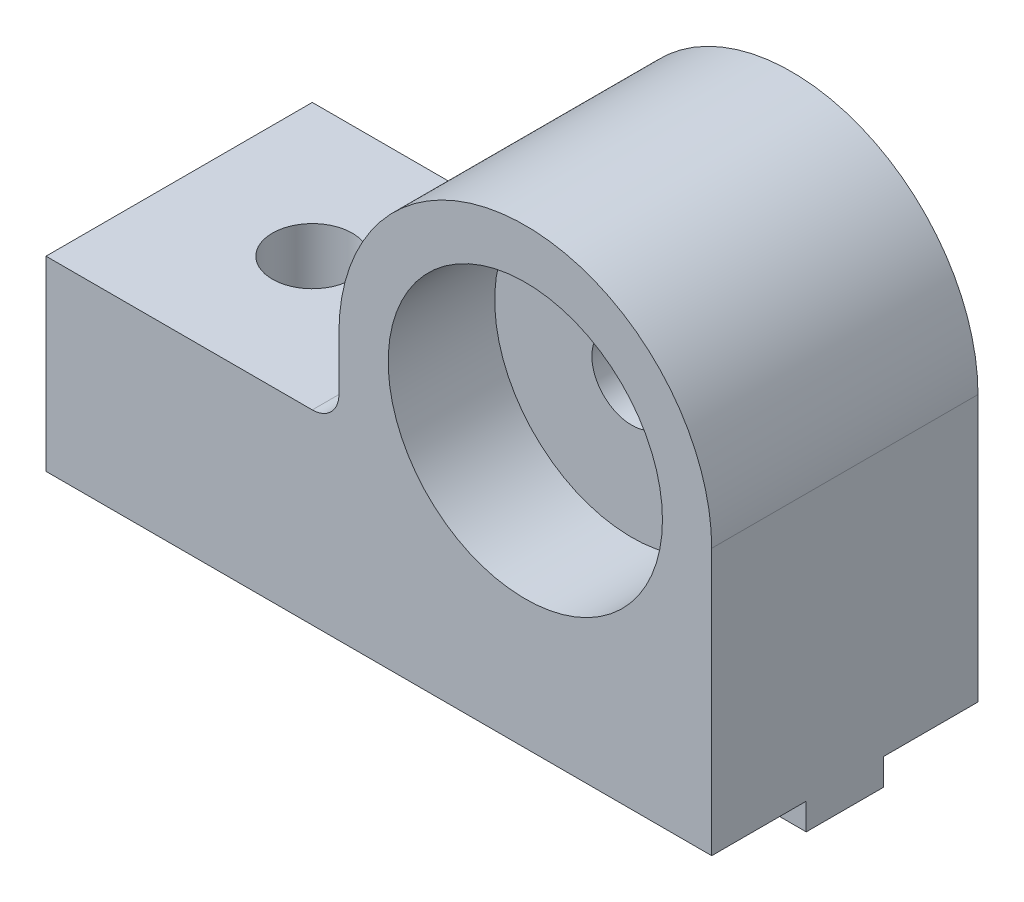
ISO-10303-21;
HEADER;
FILE_DESCRIPTION(('STEP AP214'),'2;1');
FILE_NAME('part.step','',(''),(''),'','','');
FILE_SCHEMA(('AUTOMOTIVE_DESIGN { 1 0 10303 214 1 1 1 1 }'));
ENDSEC;
DATA;
#1=APPLICATION_CONTEXT('core data for automotive mechanical design processes');
#2=APPLICATION_PROTOCOL_DEFINITION('international standard','automotive_design',2000,#1);
#3=PRODUCT_CONTEXT('',#1,'mechanical');
#4=PRODUCT('Part','Part','',(#3));
#5=PRODUCT_RELATED_PRODUCT_CATEGORY('part','',(#4));
#6=PRODUCT_DEFINITION_FORMATION('','',#4);
#7=PRODUCT_DEFINITION_CONTEXT('part definition',#1,'design');
#8=PRODUCT_DEFINITION('design','',#6,#7);
#9=PRODUCT_DEFINITION_SHAPE('','',#8);
#10=(LENGTH_UNIT() NAMED_UNIT(*) SI_UNIT(.MILLI.,.METRE.));
#11=(NAMED_UNIT(*) PLANE_ANGLE_UNIT() SI_UNIT($,.RADIAN.));
#12=(NAMED_UNIT(*) SI_UNIT($,.STERADIAN.) SOLID_ANGLE_UNIT());
#13=UNCERTAINTY_MEASURE_WITH_UNIT(LENGTH_MEASURE(1.E-05),#10,'distance_accuracy_value','');
#14=(GEOMETRIC_REPRESENTATION_CONTEXT(3) GLOBAL_UNCERTAINTY_ASSIGNED_CONTEXT((#13)) GLOBAL_UNIT_ASSIGNED_CONTEXT((#10,
#11,#12)) REPRESENTATION_CONTEXT('',''));
#15=CARTESIAN_POINT('',(0.,0.,0.));
#16=DIRECTION('',(0.,0.,1.));
#17=DIRECTION('',(1.,0.,0.));
#18=AXIS2_PLACEMENT_3D('',#15,#16,#17);
#19=CARTESIAN_POINT('',(0.,10.,5.));
#20=DIRECTION('',(0.,0.,-1.));
#21=DIRECTION('',(-1.,0.,0.));
#22=AXIS2_PLACEMENT_3D('',#19,#20,#21);
#23=CYLINDRICAL_SURFACE('',#22,1.5);
#24=CARTESIAN_POINT('',(0.,10.,1.));
#25=DIRECTION('',(0.,0.,1.));
#26=DIRECTION('',(1.,0.,0.));
#27=AXIS2_PLACEMENT_3D('',#24,#25,#26);
#28=CIRCLE('',#27,1.5);
#29=CARTESIAN_POINT('',(1.5,10.,1.));
#30=VERTEX_POINT('',#29);
#31=EDGE_CURVE('E224',#30,#30,#28,.T.);
#32=ORIENTED_EDGE('',*,*,#31,.T.);
#33=EDGE_LOOP('',(#32));
#34=FACE_BOUND('',#33,.T.);
#35=CARTESIAN_POINT('',(0.,10.,-1.));
#36=DIRECTION('',(0.,0.,-1.));
#37=DIRECTION('',(-1.,0.,0.));
#38=AXIS2_PLACEMENT_3D('',#35,#36,#37);
#39=CIRCLE('',#38,1.5);
#40=CARTESIAN_POINT('',(-1.5,10.,-1.));
#41=VERTEX_POINT('',#40);
#42=EDGE_CURVE('E228',#41,#41,#39,.T.);
#43=ORIENTED_EDGE('',*,*,#42,.T.);
#44=EDGE_LOOP('',(#43));
#45=FACE_BOUND('',#44,.T.);
#46=ADVANCED_FACE('F33',(#34,#45),#23,.F.);
#47=CARTESIAN_POINT('',(10.0675723300356,0.,-1.45));
#48=DIRECTION('',(0.,0.,-1.));
#49=DIRECTION('',(-1.,0.,0.));
#50=AXIS2_PLACEMENT_3D('',#47,#48,#49);
#51=PLANE('',#50);
#52=DIRECTION('',(0.,1.,0.));
#53=VECTOR('',#52,1.);
#54=CARTESIAN_POINT('',(-13.3840572873934,-1.,-1.45));
#55=LINE('',#54,#53);
#56=CARTESIAN_POINT('',(-13.3840572873934,-1.,-1.45));
#57=VERTEX_POINT('',#56);
#58=CARTESIAN_POINT('',(-13.3840572873934,0.,-1.45));
#59=VERTEX_POINT('',#58);
#60=EDGE_CURVE('E477',#57,#59,#55,.T.);
#61=ORIENTED_EDGE('',*,*,#60,.F.);
#62=DIRECTION('',(-1.,0.,0.));
#63=VECTOR('',#62,1.);
#64=CARTESIAN_POINT('',(10.0675723300356,-0.99999999999999,-1.45));
#65=LINE('',#64,#63);
#66=CARTESIAN_POINT('',(-18.,-0.999999999999997,-1.45));
#67=VERTEX_POINT('',#66);
#68=EDGE_CURVE('E158',#57,#67,#65,.T.);
#69=ORIENTED_EDGE('',*,*,#68,.T.);
#70=DIRECTION('',(0.,-1.,0.));
#71=VECTOR('',#70,1.);
#72=CARTESIAN_POINT('',(-18.,0.,-1.45));
#73=LINE('',#72,#71);
#74=CARTESIAN_POINT('',(-18.,0.,-1.45));
#75=VERTEX_POINT('',#74);
#76=EDGE_CURVE('E474',#75,#67,#73,.T.);
#77=ORIENTED_EDGE('',*,*,#76,.F.);
#78=DIRECTION('',(-1.,0.,0.));
#79=VECTOR('',#78,1.);
#80=CARTESIAN_POINT('',(10.0675723300356,0.,-1.45));
#81=LINE('',#80,#79);
#82=EDGE_CURVE('E479',#59,#75,#81,.T.);
#83=ORIENTED_EDGE('',*,*,#82,.F.);
#84=EDGE_LOOP('',(#61,#69,#77,#83));
#85=FACE_BOUND('',#84,.T.);
#86=ADVANCED_FACE('F265',(#85),#51,.T.);
#87=CARTESIAN_POINT('',(10.0675723300356,0.,1.45));
#88=DIRECTION('',(0.,0.,1.));
#89=DIRECTION('',(1.,0.,0.));
#90=AXIS2_PLACEMENT_3D('',#87,#88,#89);
#91=PLANE('',#90);
#92=DIRECTION('',(0.,1.,0.));
#93=VECTOR('',#92,1.);
#94=CARTESIAN_POINT('',(-12.6159427126066,-1.,1.45));
#95=LINE('',#94,#93);
#96=CARTESIAN_POINT('',(-12.6159427126066,-1.,1.45));
#97=VERTEX_POINT('',#96);
#98=CARTESIAN_POINT('',(-12.6159427126066,0.,1.45));
#99=VERTEX_POINT('',#98);
#100=EDGE_CURVE('E456',#97,#99,#95,.T.);
#101=ORIENTED_EDGE('',*,*,#100,.F.);
#102=DIRECTION('',(-1.,0.,0.));
#103=VECTOR('',#102,1.);
#104=CARTESIAN_POINT('',(10.0675723300356,-0.99999999999999,1.45));
#105=LINE('',#104,#103);
#106=CARTESIAN_POINT('',(7.,-0.999999999999991,1.45));
#107=VERTEX_POINT('',#106);
#108=EDGE_CURVE('E166',#107,#97,#105,.T.);
#109=ORIENTED_EDGE('',*,*,#108,.F.);
#110=DIRECTION('',(0.,-1.,0.));
#111=VECTOR('',#110,1.);
#112=CARTESIAN_POINT('',(7.,0.,1.45));
#113=LINE('',#112,#111);
#114=CARTESIAN_POINT('',(7.,0.,1.45));
#115=VERTEX_POINT('',#114);
#116=EDGE_CURVE('E466',#115,#107,#113,.T.);
#117=ORIENTED_EDGE('',*,*,#116,.F.);
#118=DIRECTION('',(-1.,0.,0.));
#119=VECTOR('',#118,1.);
#120=CARTESIAN_POINT('',(10.0675723300356,0.,1.45));
#121=LINE('',#120,#119);
#122=EDGE_CURVE('E174',#115,#99,#121,.T.);
#123=ORIENTED_EDGE('',*,*,#122,.T.);
#124=EDGE_LOOP('',(#101,#109,#117,#123));
#125=FACE_BOUND('',#124,.T.);
#126=ADVANCED_FACE('F271',(#125),#91,.T.);
#127=CARTESIAN_POINT('',(10.0675723300356,-0.99999999999999,-1.45));
#128=DIRECTION('',(0.,-1.,0.));
#129=DIRECTION('',(1.,0.,0.));
#130=AXIS2_PLACEMENT_3D('',#127,#128,#129);
#131=PLANE('',#130);
#132=CARTESIAN_POINT('',(-13.,-0.999999999999996,0.));
#133=DIRECTION('',(0.,-1.,0.));
#134=DIRECTION('',(1.,0.,0.));
#135=AXIS2_PLACEMENT_3D('',#132,#133,#134);
#136=CIRCLE('',#135,1.5);
#137=CARTESIAN_POINT('',(-13.3840572873934,-1.,1.45));
#138=VERTEX_POINT('',#137);
#139=EDGE_CURVE('E143',#138,#57,#136,.T.);
#140=ORIENTED_EDGE('',*,*,#139,.F.);
#141=CARTESIAN_POINT('',(-18.,-0.999999999999997,1.45));
#142=VERTEX_POINT('',#141);
#143=EDGE_CURVE('E156',#138,#142,#105,.T.);
#144=ORIENTED_EDGE('',*,*,#143,.T.);
#145=DIRECTION('',(0.,0.,1.));
#146=VECTOR('',#145,1.);
#147=CARTESIAN_POINT('',(-18.,-0.999999999999997,-1.45));
#148=LINE('',#147,#146);
#149=EDGE_CURVE('E476',#67,#142,#148,.T.);
#150=ORIENTED_EDGE('',*,*,#149,.F.);
#151=ORIENTED_EDGE('',*,*,#68,.F.);
#152=EDGE_LOOP('',(#140,#144,#150,#151));
#153=FACE_BOUND('',#152,.T.);
#154=ADVANCED_FACE('F154',(#153),#131,.T.);
#155=CARTESIAN_POINT('',(-18.,0.,5.));
#156=DIRECTION('',(0.,1.,0.));
#157=DIRECTION('',(0.,0.,1.));
#158=AXIS2_PLACEMENT_3D('',#155,#156,#157);
#159=PLANE('',#158);
#160=CARTESIAN_POINT('',(-13.3840572873934,0.,1.45));
#161=VERTEX_POINT('',#160);
#162=CARTESIAN_POINT('',(-18.,0.,1.45));
#163=VERTEX_POINT('',#162);
#164=EDGE_CURVE('E170',#161,#163,#121,.T.);
#165=ORIENTED_EDGE('',*,*,#164,.F.);
#166=CARTESIAN_POINT('',(-13.,0.,0.));
#167=DIRECTION('',(0.,1.,0.));
#168=DIRECTION('',(0.,0.,1.));
#169=AXIS2_PLACEMENT_3D('',#166,#167,#168);
#170=CIRCLE('',#169,1.5);
#171=EDGE_CURVE('E146',#161,#99,#170,.T.);
#172=ORIENTED_EDGE('',*,*,#171,.T.);
#173=ORIENTED_EDGE('',*,*,#122,.F.);
#174=DIRECTION('',(0.,0.,-1.));
#175=VECTOR('',#174,1.);
#176=CARTESIAN_POINT('',(7.,0.,5.));
#177=LINE('',#176,#175);
#178=CARTESIAN_POINT('',(7.,0.,5.));
#179=VERTEX_POINT('',#178);
#180=EDGE_CURVE('E217',#179,#115,#177,.T.);
#181=ORIENTED_EDGE('',*,*,#180,.F.);
#182=DIRECTION('',(1.,0.,0.));
#183=VECTOR('',#182,1.);
#184=CARTESIAN_POINT('',(-18.,0.,5.));
#185=LINE('',#184,#183);
#186=CARTESIAN_POINT('',(-18.,0.,5.));
#187=VERTEX_POINT('',#186);
#188=EDGE_CURVE('E184',#187,#179,#185,.T.);
#189=ORIENTED_EDGE('',*,*,#188,.F.);
#190=DIRECTION('',(0.,0.,-1.));
#191=VECTOR('',#190,1.);
#192=CARTESIAN_POINT('',(-18.,0.,5.));
#193=LINE('',#192,#191);
#194=EDGE_CURVE('E221',#187,#163,#193,.T.);
#195=ORIENTED_EDGE('',*,*,#194,.T.);
#196=EDGE_LOOP('',(#165,#172,#173,#181,#189,#195));
#197=FACE_BOUND('',#196,.T.);
#198=ADVANCED_FACE('F280',(#197),#159,.F.);
#199=CARTESIAN_POINT('',(0.,10.,5.));
#200=DIRECTION('',(0.,0.,-1.));
#201=DIRECTION('',(-1.,0.,0.));
#202=AXIS2_PLACEMENT_3D('',#199,#200,#201);
#203=PLANE('',#202);
#204=CARTESIAN_POINT('',(0.,10.,5.));
#205=DIRECTION('',(0.,0.,1.));
#206=DIRECTION('',(1.,0.,0.));
#207=AXIS2_PLACEMENT_3D('',#204,#205,#206);
#208=CIRCLE('',#207,5.15);
#209=CARTESIAN_POINT('',(5.15,10.,5.));
#210=VERTEX_POINT('',#209);
#211=EDGE_CURVE('E231',#210,#210,#208,.T.);
#212=ORIENTED_EDGE('',*,*,#211,.F.);
#213=EDGE_LOOP('',(#212));
#214=FACE_BOUND('',#213,.T.);
#215=DIRECTION('',(0.,-1.,0.));
#216=VECTOR('',#215,1.);
#217=CARTESIAN_POINT('',(-18.,7.,5.));
#218=LINE('',#217,#216);
#219=CARTESIAN_POINT('',(-18.,7.,5.));
#220=VERTEX_POINT('',#219);
#221=EDGE_CURVE('E181',#220,#187,#218,.T.);
#222=ORIENTED_EDGE('',*,*,#221,.T.);
#223=ORIENTED_EDGE('',*,*,#188,.T.);
#224=DIRECTION('',(0.,1.,0.));
#225=VECTOR('',#224,1.);
#226=CARTESIAN_POINT('',(7.,0.,5.));
#227=LINE('',#226,#225);
#228=CARTESIAN_POINT('',(7.,10.,5.));
#229=VERTEX_POINT('',#228);
#230=EDGE_CURVE('E187',#179,#229,#227,.T.);
#231=ORIENTED_EDGE('',*,*,#230,.T.);
#232=CARTESIAN_POINT('',(0.,10.,5.));
#233=DIRECTION('',(0.,0.,1.));
#234=DIRECTION('',(-1.,0.,0.));
#235=AXIS2_PLACEMENT_3D('',#232,#233,#234);
#236=CIRCLE('',#235,7.);
#237=CARTESIAN_POINT('',(-7.,10.,5.));
#238=VERTEX_POINT('',#237);
#239=EDGE_CURVE('E189',#229,#238,#236,.T.);
#240=ORIENTED_EDGE('',*,*,#239,.T.);
#241=DIRECTION('',(0.,-1.,0.));
#242=VECTOR('',#241,1.);
#243=CARTESIAN_POINT('',(-7.,10.,5.));
#244=LINE('',#243,#242);
#245=CARTESIAN_POINT('',(-7.,8.,5.));
#246=VERTEX_POINT('',#245);
#247=EDGE_CURVE('E191',#238,#246,#244,.T.);
#248=ORIENTED_EDGE('',*,*,#247,.T.);
#249=CARTESIAN_POINT('',(-8.,8.,5.));
#250=DIRECTION('',(0.,0.,-1.));
#251=DIRECTION('',(-1.,0.,0.));
#252=AXIS2_PLACEMENT_3D('',#249,#250,#251);
#253=CIRCLE('',#252,1.);
#254=CARTESIAN_POINT('',(-8.,7.,5.));
#255=VERTEX_POINT('',#254);
#256=EDGE_CURVE('E11',#246,#255,#253,.T.);
#257=ORIENTED_EDGE('',*,*,#256,.T.);
#258=DIRECTION('',(-1.,0.,0.));
#259=VECTOR('',#258,1.);
#260=CARTESIAN_POINT('',(-7.,7.,5.));
#261=LINE('',#260,#259);
#262=EDGE_CURVE('E193',#255,#220,#261,.T.);
#263=ORIENTED_EDGE('',*,*,#262,.T.);
#264=EDGE_LOOP('',(#222,#223,#231,#240,#248,#257,#263));
#265=FACE_BOUND('',#264,.T.);
#266=ADVANCED_FACE('F254',(#214,#265),#203,.F.);
#267=CARTESIAN_POINT('',(0.,10.,-5.));
#268=DIRECTION('',(0.,0.,-1.));
#269=DIRECTION('',(-1.,0.,0.));
#270=AXIS2_PLACEMENT_3D('',#267,#268,#269);
#271=PLANE('',#270);
#272=CARTESIAN_POINT('',(0.,10.,-5.));
#273=DIRECTION('',(0.,0.,1.));
#274=DIRECTION('',(1.,0.,0.));
#275=AXIS2_PLACEMENT_3D('',#272,#273,#274);
#276=CIRCLE('',#275,5.15);
#277=CARTESIAN_POINT('',(5.15,10.,-5.));
#278=VERTEX_POINT('',#277);
#279=EDGE_CURVE('E493',#278,#278,#276,.T.);
#280=ORIENTED_EDGE('',*,*,#279,.T.);
#281=EDGE_LOOP('',(#280));
#282=FACE_BOUND('',#281,.T.);
#283=DIRECTION('',(0.,-1.,0.));
#284=VECTOR('',#283,1.);
#285=CARTESIAN_POINT('',(-18.,7.,-5.));
#286=LINE('',#285,#284);
#287=CARTESIAN_POINT('',(-18.,7.,-5.));
#288=VERTEX_POINT('',#287);
#289=CARTESIAN_POINT('',(-18.,0.,-5.));
#290=VERTEX_POINT('',#289);
#291=EDGE_CURVE('E179',#288,#290,#286,.T.);
#292=ORIENTED_EDGE('',*,*,#291,.F.);
#293=DIRECTION('',(-1.,0.,0.));
#294=VECTOR('',#293,1.);
#295=CARTESIAN_POINT('',(-7.,7.,-5.));
#296=LINE('',#295,#294);
#297=CARTESIAN_POINT('',(-8.,7.,-5.));
#298=VERTEX_POINT('',#297);
#299=EDGE_CURVE('E185',#298,#288,#296,.T.);
#300=ORIENTED_EDGE('',*,*,#299,.F.);
#301=CARTESIAN_POINT('',(-8.,8.,-5.));
#302=DIRECTION('',(0.,0.,-1.));
#303=DIRECTION('',(-1.,0.,0.));
#304=AXIS2_PLACEMENT_3D('',#301,#302,#303);
#305=CIRCLE('',#304,1.);
#306=CARTESIAN_POINT('',(-7.,8.,-5.));
#307=VERTEX_POINT('',#306);
#308=EDGE_CURVE('E41',#298,#307,#305,.F.);
#309=ORIENTED_EDGE('',*,*,#308,.T.);
#310=DIRECTION('',(0.,-1.,0.));
#311=VECTOR('',#310,1.);
#312=CARTESIAN_POINT('',(-7.,10.,-5.));
#313=LINE('',#312,#311);
#314=CARTESIAN_POINT('',(-7.,10.,-5.));
#315=VERTEX_POINT('',#314);
#316=EDGE_CURVE('E205',#315,#307,#313,.T.);
#317=ORIENTED_EDGE('',*,*,#316,.F.);
#318=CARTESIAN_POINT('',(0.,10.,-5.));
#319=DIRECTION('',(0.,0.,1.));
#320=DIRECTION('',(-1.,0.,0.));
#321=AXIS2_PLACEMENT_3D('',#318,#319,#320);
#322=CIRCLE('',#321,7.);
#323=CARTESIAN_POINT('',(7.,10.,-5.));
#324=VERTEX_POINT('',#323);
#325=EDGE_CURVE('E203',#324,#315,#322,.T.);
#326=ORIENTED_EDGE('',*,*,#325,.F.);
#327=DIRECTION('',(0.,1.,0.));
#328=VECTOR('',#327,1.);
#329=CARTESIAN_POINT('',(7.,0.,-5.));
#330=LINE('',#329,#328);
#331=CARTESIAN_POINT('',(7.,0.,-5.));
#332=VERTEX_POINT('',#331);
#333=EDGE_CURVE('E201',#332,#324,#330,.T.);
#334=ORIENTED_EDGE('',*,*,#333,.F.);
#335=DIRECTION('',(1.,0.,0.));
#336=VECTOR('',#335,1.);
#337=CARTESIAN_POINT('',(-18.,0.,-5.));
#338=LINE('',#337,#336);
#339=EDGE_CURVE('E198',#290,#332,#338,.T.);
#340=ORIENTED_EDGE('',*,*,#339,.F.);
#341=EDGE_LOOP('',(#292,#300,#309,#317,#326,#334,#340));
#342=FACE_BOUND('',#341,.T.);
#343=ADVANCED_FACE('F243',(#282,#342),#271,.T.);
#344=CARTESIAN_POINT('',(-18.,7.,5.));
#345=DIRECTION('',(1.,0.,0.));
#346=DIRECTION('',(0.,0.,-1.));
#347=AXIS2_PLACEMENT_3D('',#344,#345,#346);
#348=PLANE('',#347);
#349=ORIENTED_EDGE('',*,*,#291,.T.);
#350=EDGE_CURVE('E220',#75,#290,#193,.T.);
#351=ORIENTED_EDGE('',*,*,#350,.F.);
#352=ORIENTED_EDGE('',*,*,#76,.T.);
#353=ORIENTED_EDGE('',*,*,#149,.T.);
#354=DIRECTION('',(0.,1.,0.));
#355=VECTOR('',#354,1.);
#356=CARTESIAN_POINT('',(-18.,0.,1.45));
#357=LINE('',#356,#355);
#358=EDGE_CURVE('E164',#142,#163,#357,.T.);
#359=ORIENTED_EDGE('',*,*,#358,.T.);
#360=ORIENTED_EDGE('',*,*,#194,.F.);
#361=ORIENTED_EDGE('',*,*,#221,.F.);
#362=DIRECTION('',(0.,0.,-1.));
#363=VECTOR('',#362,1.);
#364=CARTESIAN_POINT('',(-18.,7.,5.));
#365=LINE('',#364,#363);
#366=EDGE_CURVE('E195',#220,#288,#365,.T.);
#367=ORIENTED_EDGE('',*,*,#366,.T.);
#368=EDGE_LOOP('',(#349,#351,#352,#353,#359,#360,#361,#367));
#369=FACE_BOUND('',#368,.T.);
#370=ADVANCED_FACE('F248',(#369),#348,.F.);
#371=CARTESIAN_POINT('',(7.,0.,-1.45));
#372=VERTEX_POINT('',#371);
#373=CARTESIAN_POINT('',(-12.6159427126066,0.,-1.45));
#374=VERTEX_POINT('',#373);
#375=EDGE_CURVE('E469',#372,#374,#81,.T.);
#376=ORIENTED_EDGE('',*,*,#375,.T.);
#377=CARTESIAN_POINT('',(-13.,0.,0.));
#378=DIRECTION('',(0.,1.,0.));
#379=DIRECTION('',(0.,0.,1.));
#380=AXIS2_PLACEMENT_3D('',#377,#378,#379);
#381=CIRCLE('',#380,1.5);
#382=EDGE_CURVE('E482',#374,#59,#381,.T.);
#383=ORIENTED_EDGE('',*,*,#382,.T.);
#384=ORIENTED_EDGE('',*,*,#82,.T.);
#385=ORIENTED_EDGE('',*,*,#350,.T.);
#386=ORIENTED_EDGE('',*,*,#339,.T.);
#387=EDGE_CURVE('E216',#372,#332,#177,.T.);
#388=ORIENTED_EDGE('',*,*,#387,.F.);
#389=EDGE_LOOP('',(#376,#383,#384,#385,#386,#388));
#390=FACE_BOUND('',#389,.T.);
#391=ADVANCED_FACE('F298',(#390),#159,.F.);
#392=CARTESIAN_POINT('',(7.,0.,5.));
#393=DIRECTION('',(-1.,0.,0.));
#394=DIRECTION('',(0.,0.,1.));
#395=AXIS2_PLACEMENT_3D('',#392,#393,#394);
#396=PLANE('',#395);
#397=ORIENTED_EDGE('',*,*,#333,.T.);
#398=DIRECTION('',(0.,0.,-1.));
#399=VECTOR('',#398,1.);
#400=CARTESIAN_POINT('',(7.,10.,5.));
#401=LINE('',#400,#399);
#402=EDGE_CURVE('E213',#229,#324,#401,.T.);
#403=ORIENTED_EDGE('',*,*,#402,.F.);
#404=ORIENTED_EDGE('',*,*,#230,.F.);
#405=ORIENTED_EDGE('',*,*,#180,.T.);
#406=ORIENTED_EDGE('',*,*,#116,.T.);
#407=DIRECTION('',(0.,0.,-1.));
#408=VECTOR('',#407,1.);
#409=CARTESIAN_POINT('',(7.,-0.999999999999991,-1.45));
#410=LINE('',#409,#408);
#411=CARTESIAN_POINT('',(7.,-0.999999999999991,-1.45));
#412=VERTEX_POINT('',#411);
#413=EDGE_CURVE('E177',#107,#412,#410,.T.);
#414=ORIENTED_EDGE('',*,*,#413,.T.);
#415=DIRECTION('',(0.,1.,0.));
#416=VECTOR('',#415,1.);
#417=CARTESIAN_POINT('',(7.,0.,-1.45));
#418=LINE('',#417,#416);
#419=EDGE_CURVE('E180',#412,#372,#418,.T.);
#420=ORIENTED_EDGE('',*,*,#419,.T.);
#421=ORIENTED_EDGE('',*,*,#387,.T.);
#422=EDGE_LOOP('',(#397,#403,#404,#405,#406,#414,#420,#421));
#423=FACE_BOUND('',#422,.T.);
#424=ADVANCED_FACE('F294',(#423),#396,.F.);
#425=CARTESIAN_POINT('',(0.,10.,5.));
#426=DIRECTION('',(0.,0.,-1.));
#427=DIRECTION('',(-1.,0.,0.));
#428=AXIS2_PLACEMENT_3D('',#425,#426,#427);
#429=CYLINDRICAL_SURFACE('',#428,7.);
#430=ORIENTED_EDGE('',*,*,#325,.T.);
#431=DIRECTION('',(0.,0.,-1.));
#432=VECTOR('',#431,1.);
#433=CARTESIAN_POINT('',(-7.,10.,5.));
#434=LINE('',#433,#432);
#435=EDGE_CURVE('E210',#238,#315,#434,.T.);
#436=ORIENTED_EDGE('',*,*,#435,.F.);
#437=ORIENTED_EDGE('',*,*,#239,.F.);
#438=ORIENTED_EDGE('',*,*,#402,.T.);
#439=EDGE_LOOP('',(#430,#436,#437,#438));
#440=FACE_BOUND('',#439,.T.);
#441=ADVANCED_FACE('F291',(#440),#429,.T.);
#442=CARTESIAN_POINT('',(-7.,10.,5.));
#443=DIRECTION('',(1.,0.,0.));
#444=DIRECTION('',(0.,1.,0.));
#445=AXIS2_PLACEMENT_3D('',#442,#443,#444);
#446=PLANE('',#445);
#447=ORIENTED_EDGE('',*,*,#316,.T.);
#448=DIRECTION('',(0.,0.,-1.));
#449=VECTOR('',#448,1.);
#450=CARTESIAN_POINT('',(-7.,8.,5.));
#451=LINE('',#450,#449);
#452=EDGE_CURVE('E48',#307,#246,#451,.F.);
#453=ORIENTED_EDGE('',*,*,#452,.T.);
#454=ORIENTED_EDGE('',*,*,#247,.F.);
#455=ORIENTED_EDGE('',*,*,#435,.T.);
#456=EDGE_LOOP('',(#447,#453,#454,#455));
#457=FACE_BOUND('',#456,.T.);
#458=ADVANCED_FACE('F287',(#457),#446,.F.);
#459=CARTESIAN_POINT('',(-7.,7.,5.));
#460=DIRECTION('',(0.,-1.,0.));
#461=DIRECTION('',(1.,0.,0.));
#462=AXIS2_PLACEMENT_3D('',#459,#460,#461);
#463=PLANE('',#462);
#464=CARTESIAN_POINT('',(-13.,7.,0.));
#465=DIRECTION('',(0.,1.,0.));
#466=DIRECTION('',(-1.,0.,0.));
#467=AXIS2_PLACEMENT_3D('',#464,#465,#466);
#468=CIRCLE('',#467,1.5);
#469=CARTESIAN_POINT('',(-14.5,7.,0.));
#470=VERTEX_POINT('',#469);
#471=EDGE_CURVE('E150',#470,#470,#468,.T.);
#472=ORIENTED_EDGE('',*,*,#471,.F.);
#473=EDGE_LOOP('',(#472));
#474=FACE_BOUND('',#473,.T.);
#475=ORIENTED_EDGE('',*,*,#262,.F.);
#476=DIRECTION('',(0.,0.,-1.));
#477=VECTOR('',#476,1.);
#478=CARTESIAN_POINT('',(-8.,7.,-5.));
#479=LINE('',#478,#477);
#480=EDGE_CURVE('E159',#255,#298,#479,.T.);
#481=ORIENTED_EDGE('',*,*,#480,.T.);
#482=ORIENTED_EDGE('',*,*,#299,.T.);
#483=ORIENTED_EDGE('',*,*,#366,.F.);
#484=EDGE_LOOP('',(#475,#481,#482,#483));
#485=FACE_BOUND('',#484,.T.);
#486=ADVANCED_FACE('F238',(#474,#485),#463,.F.);
#487=DIRECTION('',(0.,1.,0.));
#488=VECTOR('',#487,1.);
#489=CARTESIAN_POINT('',(-12.6159427126066,-1.,-1.45));
#490=LINE('',#489,#488);
#491=CARTESIAN_POINT('',(-12.6159427126066,-0.999999999999996,-1.45));
#492=VERTEX_POINT('',#491);
#493=EDGE_CURVE('E459',#374,#492,#490,.F.);
#494=ORIENTED_EDGE('',*,*,#493,.F.);
#495=ORIENTED_EDGE('',*,*,#375,.F.);
#496=ORIENTED_EDGE('',*,*,#419,.F.);
#497=EDGE_CURVE('E167',#412,#492,#65,.T.);
#498=ORIENTED_EDGE('',*,*,#497,.T.);
#499=EDGE_LOOP('',(#494,#495,#496,#498));
#500=FACE_BOUND('',#499,.T.);
#501=ADVANCED_FACE('F274',(#500),#51,.T.);
#502=DIRECTION('',(0.,1.,0.));
#503=VECTOR('',#502,1.);
#504=CARTESIAN_POINT('',(-13.3840572873934,-1.,1.45));
#505=LINE('',#504,#503);
#506=EDGE_CURVE('E139',#161,#138,#505,.F.);
#507=ORIENTED_EDGE('',*,*,#506,.F.);
#508=ORIENTED_EDGE('',*,*,#164,.T.);
#509=ORIENTED_EDGE('',*,*,#358,.F.);
#510=ORIENTED_EDGE('',*,*,#143,.F.);
#511=EDGE_LOOP('',(#507,#508,#509,#510));
#512=FACE_BOUND('',#511,.T.);
#513=ADVANCED_FACE('F162',(#512),#91,.T.);
#514=EDGE_CURVE('E160',#492,#97,#136,.T.);
#515=ORIENTED_EDGE('',*,*,#514,.F.);
#516=ORIENTED_EDGE('',*,*,#497,.F.);
#517=ORIENTED_EDGE('',*,*,#413,.F.);
#518=ORIENTED_EDGE('',*,*,#108,.T.);
#519=EDGE_LOOP('',(#515,#516,#517,#518));
#520=FACE_BOUND('',#519,.T.);
#521=ADVANCED_FACE('F341',(#520),#131,.T.);
#522=CARTESIAN_POINT('',(-13.,-1.,0.));
#523=DIRECTION('',(0.,1.,0.));
#524=DIRECTION('',(-1.,0.,0.));
#525=AXIS2_PLACEMENT_3D('',#522,#523,#524);
#526=CYLINDRICAL_SURFACE('',#525,1.5);
#527=ORIENTED_EDGE('',*,*,#60,.T.);
#528=ORIENTED_EDGE('',*,*,#382,.F.);
#529=ORIENTED_EDGE('',*,*,#493,.T.);
#530=ORIENTED_EDGE('',*,*,#514,.T.);
#531=ORIENTED_EDGE('',*,*,#100,.T.);
#532=ORIENTED_EDGE('',*,*,#171,.F.);
#533=ORIENTED_EDGE('',*,*,#506,.T.);
#534=ORIENTED_EDGE('',*,*,#139,.T.);
#535=EDGE_LOOP('',(#527,#528,#529,#530,#531,#532,#533,#534));
#536=FACE_BOUND('',#535,.T.);
#537=ORIENTED_EDGE('',*,*,#471,.T.);
#538=EDGE_LOOP('',(#537));
#539=FACE_BOUND('',#538,.T.);
#540=ADVANCED_FACE('F141',(#536,#539),#526,.F.);
#541=CARTESIAN_POINT('',(0.,10.,1.));
#542=DIRECTION('',(0.,0.,1.));
#543=DIRECTION('',(1.,0.,0.));
#544=AXIS2_PLACEMENT_3D('',#541,#542,#543);
#545=CYLINDRICAL_SURFACE('',#544,5.15);
#546=CARTESIAN_POINT('',(0.,10.,1.));
#547=DIRECTION('',(0.,0.,1.));
#548=DIRECTION('',(1.,0.,0.));
#549=AXIS2_PLACEMENT_3D('',#546,#547,#548);
#550=CIRCLE('',#549,5.15);
#551=CARTESIAN_POINT('',(5.15,10.,1.));
#552=VERTEX_POINT('',#551);
#553=EDGE_CURVE('E227',#552,#552,#550,.T.);
#554=ORIENTED_EDGE('',*,*,#553,.F.);
#555=EDGE_LOOP('',(#554));
#556=FACE_BOUND('',#555,.T.);
#557=ORIENTED_EDGE('',*,*,#211,.T.);
#558=EDGE_LOOP('',(#557));
#559=FACE_BOUND('',#558,.T.);
#560=ADVANCED_FACE('F354',(#556,#559),#545,.F.);
#561=CARTESIAN_POINT('',(0.,10.,1.));
#562=DIRECTION('',(0.,0.,1.));
#563=DIRECTION('',(1.,0.,0.));
#564=AXIS2_PLACEMENT_3D('',#561,#562,#563);
#565=PLANE('',#564);
#566=ORIENTED_EDGE('',*,*,#31,.F.);
#567=EDGE_LOOP('',(#566));
#568=FACE_BOUND('',#567,.T.);
#569=ORIENTED_EDGE('',*,*,#553,.T.);
#570=EDGE_LOOP('',(#569));
#571=FACE_BOUND('',#570,.T.);
#572=ADVANCED_FACE('F361',(#568,#571),#565,.T.);
#573=CARTESIAN_POINT('',(0.,10.,-1.));
#574=DIRECTION('',(0.,0.,-1.));
#575=DIRECTION('',(-1.,0.,0.));
#576=AXIS2_PLACEMENT_3D('',#573,#574,#575);
#577=CYLINDRICAL_SURFACE('',#576,5.15);
#578=CARTESIAN_POINT('',(0.,10.,-1.));
#579=DIRECTION('',(0.,0.,1.));
#580=DIRECTION('',(1.,0.,0.));
#581=AXIS2_PLACEMENT_3D('',#578,#579,#580);
#582=CIRCLE('',#581,5.15);
#583=CARTESIAN_POINT('',(5.15,10.,-1.));
#584=VERTEX_POINT('',#583);
#585=EDGE_CURVE('E232',#584,#584,#582,.T.);
#586=ORIENTED_EDGE('',*,*,#585,.T.);
#587=EDGE_LOOP('',(#586));
#588=FACE_BOUND('',#587,.T.);
#589=ORIENTED_EDGE('',*,*,#279,.F.);
#590=EDGE_LOOP('',(#589));
#591=FACE_BOUND('',#590,.T.);
#592=ADVANCED_FACE('F261',(#588,#591),#577,.F.);
#593=CARTESIAN_POINT('',(0.,10.,-1.));
#594=DIRECTION('',(0.,0.,-1.));
#595=DIRECTION('',(1.,0.,0.));
#596=AXIS2_PLACEMENT_3D('',#593,#594,#595);
#597=PLANE('',#596);
#598=ORIENTED_EDGE('',*,*,#42,.F.);
#599=EDGE_LOOP('',(#598));
#600=FACE_BOUND('',#599,.T.);
#601=ORIENTED_EDGE('',*,*,#585,.F.);
#602=EDGE_LOOP('',(#601));
#603=FACE_BOUND('',#602,.T.);
#604=ADVANCED_FACE('F257',(#600,#603),#597,.T.);
#605=CARTESIAN_POINT('',(-8.,8.,5.));
#606=DIRECTION('',(0.,0.,1.));
#607=DIRECTION('',(1.,0.,0.));
#608=AXIS2_PLACEMENT_3D('',#605,#606,#607);
#609=CYLINDRICAL_SURFACE('',#608,1.);
#610=ORIENTED_EDGE('',*,*,#256,.F.);
#611=ORIENTED_EDGE('',*,*,#452,.F.);
#612=ORIENTED_EDGE('',*,*,#308,.F.);
#613=ORIENTED_EDGE('',*,*,#480,.F.);
#614=EDGE_LOOP('',(#610,#611,#612,#613));
#615=FACE_BOUND('',#614,.T.);
#616=ADVANCED_FACE('F35',(#615),#609,.F.);
#617=CLOSED_SHELL('',(#46,#86,#126,#154,#198,#266,#343,#370,#391,#424,#441,#458,#486,#501,#513,
#521,#540,#560,#572,#592,#604,#616));
#618=MANIFOLD_SOLID_BREP('B2',#617);
#619=ADVANCED_BREP_SHAPE_REPRESENTATION('',(#18,#618),#14);
#620=SHAPE_DEFINITION_REPRESENTATION(#9,#619);
ENDSEC;
END-ISO-10303-21;
